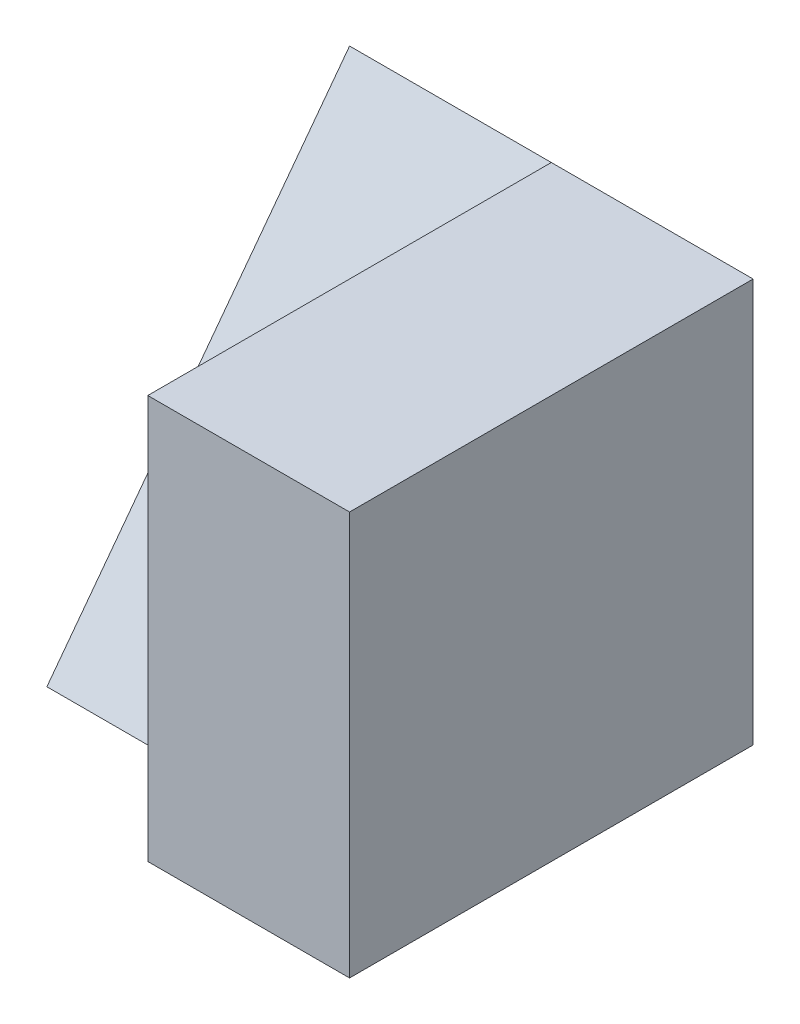
ISO-10303-21;
HEADER;
FILE_DESCRIPTION(('STEP AP214'),'2;1');
FILE_NAME('part.step','',(''),(''),'','','');
FILE_SCHEMA(('AUTOMOTIVE_DESIGN { 1 0 10303 214 1 1 1 1 }'));
ENDSEC;
DATA;
#1=APPLICATION_CONTEXT('core data for automotive mechanical design processes');
#2=APPLICATION_PROTOCOL_DEFINITION('international standard','automotive_design',2000,#1);
#3=PRODUCT_CONTEXT('',#1,'mechanical');
#4=PRODUCT('Part','Part','',(#3));
#5=PRODUCT_RELATED_PRODUCT_CATEGORY('part','',(#4));
#6=PRODUCT_DEFINITION_FORMATION('','',#4);
#7=PRODUCT_DEFINITION_CONTEXT('part definition',#1,'design');
#8=PRODUCT_DEFINITION('design','',#6,#7);
#9=PRODUCT_DEFINITION_SHAPE('','',#8);
#10=(LENGTH_UNIT() NAMED_UNIT(*) SI_UNIT(.MILLI.,.METRE.));
#11=(NAMED_UNIT(*) PLANE_ANGLE_UNIT() SI_UNIT($,.RADIAN.));
#12=(NAMED_UNIT(*) SI_UNIT($,.STERADIAN.) SOLID_ANGLE_UNIT());
#13=UNCERTAINTY_MEASURE_WITH_UNIT(LENGTH_MEASURE(1.E-05),#10,'distance_accuracy_value','');
#14=(GEOMETRIC_REPRESENTATION_CONTEXT(3) GLOBAL_UNCERTAINTY_ASSIGNED_CONTEXT((#13)) GLOBAL_UNIT_ASSIGNED_CONTEXT((#10,
#11,#12)) REPRESENTATION_CONTEXT('',''));
#15=CARTESIAN_POINT('',(0.,0.,0.));
#16=DIRECTION('',(0.,0.,1.));
#17=DIRECTION('',(1.,0.,0.));
#18=AXIS2_PLACEMENT_3D('',#15,#16,#17);
#19=CARTESIAN_POINT('',(0.,0.,4.));
#20=DIRECTION('',(1.,0.,0.));
#21=DIRECTION('',(0.,0.,-1.));
#22=AXIS2_PLACEMENT_3D('',#19,#20,#21);
#23=PLANE('',#22);
#24=DIRECTION('',(0.,0.,-1.));
#25=VECTOR('',#24,1.);
#26=CARTESIAN_POINT('',(0.,0.,4.));
#27=LINE('',#26,#25);
#28=CARTESIAN_POINT('',(0.,0.,3.));
#29=VERTEX_POINT('',#28);
#30=CARTESIAN_POINT('',(0.,0.,0.));
#31=VERTEX_POINT('',#30);
#32=EDGE_CURVE('E11',#29,#31,#27,.T.);
#33=ORIENTED_EDGE('',*,*,#32,.F.);
#34=DIRECTION('',(0.,-0.8,0.6));
#35=VECTOR('',#34,1.);
#36=CARTESIAN_POINT('',(0.,4.,0.));
#37=LINE('',#36,#35);
#38=CARTESIAN_POINT('',(0.,4.,0.));
#39=VERTEX_POINT('',#38);
#40=EDGE_CURVE('E108',#39,#29,#37,.T.);
#41=ORIENTED_EDGE('',*,*,#40,.F.);
#42=DIRECTION('',(0.,-1.,0.));
#43=VECTOR('',#42,1.);
#44=CARTESIAN_POINT('',(0.,0.,0.));
#45=LINE('',#44,#43);
#46=EDGE_CURVE('E98',#39,#31,#45,.T.);
#47=ORIENTED_EDGE('',*,*,#46,.T.);
#48=EDGE_LOOP('',(#33,#41,#47));
#49=FACE_BOUND('',#48,.T.);
#50=ADVANCED_FACE('F33',(#49),#23,.F.);
#51=CARTESIAN_POINT('',(0.,0.,4.));
#52=DIRECTION('',(0.,1.,0.));
#53=DIRECTION('',(0.,0.,1.));
#54=AXIS2_PLACEMENT_3D('',#51,#52,#53);
#55=PLANE('',#54);
#56=DIRECTION('',(0.,0.,1.));
#57=VECTOR('',#56,1.);
#58=CARTESIAN_POINT('',(2.,0.,3.));
#59=LINE('',#58,#57);
#60=CARTESIAN_POINT('',(2.,0.,3.));
#61=VERTEX_POINT('',#60);
#62=CARTESIAN_POINT('',(2.,0.,4.));
#63=VERTEX_POINT('',#62);
#64=EDGE_CURVE('E112',#61,#63,#59,.T.);
#65=ORIENTED_EDGE('',*,*,#64,.F.);
#66=DIRECTION('',(-1.,0.,0.));
#67=VECTOR('',#66,1.);
#68=CARTESIAN_POINT('',(2.,0.,3.));
#69=LINE('',#68,#67);
#70=EDGE_CURVE('E101',#61,#29,#69,.T.);
#71=ORIENTED_EDGE('',*,*,#70,.T.);
#72=ORIENTED_EDGE('',*,*,#32,.T.);
#73=DIRECTION('',(1.,0.,0.));
#74=VECTOR('',#73,1.);
#75=CARTESIAN_POINT('',(0.,0.,0.));
#76=LINE('',#75,#74);
#77=CARTESIAN_POINT('',(4.,0.,0.));
#78=VERTEX_POINT('',#77);
#79=EDGE_CURVE('E81',#31,#78,#76,.T.);
#80=ORIENTED_EDGE('',*,*,#79,.T.);
#81=DIRECTION('',(0.,0.,-1.));
#82=VECTOR('',#81,1.);
#83=CARTESIAN_POINT('',(4.,0.,4.));
#84=LINE('',#83,#82);
#85=CARTESIAN_POINT('',(4.,0.,4.));
#86=VERTEX_POINT('',#85);
#87=EDGE_CURVE('E40',#86,#78,#84,.T.);
#88=ORIENTED_EDGE('',*,*,#87,.F.);
#89=DIRECTION('',(1.,0.,0.));
#90=VECTOR('',#89,1.);
#91=CARTESIAN_POINT('',(0.,0.,4.));
#92=LINE('',#91,#90);
#93=EDGE_CURVE('E93',#63,#86,#92,.T.);
#94=ORIENTED_EDGE('',*,*,#93,.F.);
#95=EDGE_LOOP('',(#65,#71,#72,#80,#88,#94));
#96=FACE_BOUND('',#95,.T.);
#97=ADVANCED_FACE('F128',(#96),#55,.F.);
#98=CARTESIAN_POINT('',(4.,0.,4.));
#99=DIRECTION('',(-1.,0.,0.));
#100=DIRECTION('',(0.,0.,1.));
#101=AXIS2_PLACEMENT_3D('',#98,#99,#100);
#102=PLANE('',#101);
#103=DIRECTION('',(0.,1.,0.));
#104=VECTOR('',#103,1.);
#105=CARTESIAN_POINT('',(4.,0.,0.));
#106=LINE('',#105,#104);
#107=CARTESIAN_POINT('',(4.,4.,0.));
#108=VERTEX_POINT('',#107);
#109=EDGE_CURVE('E71',#78,#108,#106,.T.);
#110=ORIENTED_EDGE('',*,*,#109,.T.);
#111=DIRECTION('',(0.,0.,-1.));
#112=VECTOR('',#111,1.);
#113=CARTESIAN_POINT('',(4.,4.,4.));
#114=LINE('',#113,#112);
#115=CARTESIAN_POINT('',(4.,4.,4.));
#116=VERTEX_POINT('',#115);
#117=EDGE_CURVE('E74',#116,#108,#114,.T.);
#118=ORIENTED_EDGE('',*,*,#117,.F.);
#119=DIRECTION('',(0.,1.,0.));
#120=VECTOR('',#119,1.);
#121=CARTESIAN_POINT('',(4.,0.,4.));
#122=LINE('',#121,#120);
#123=EDGE_CURVE('E56',#86,#116,#122,.T.);
#124=ORIENTED_EDGE('',*,*,#123,.F.);
#125=ORIENTED_EDGE('',*,*,#87,.T.);
#126=EDGE_LOOP('',(#110,#118,#124,#125));
#127=FACE_BOUND('',#126,.T.);
#128=ADVANCED_FACE('F73',(#127),#102,.F.);
#129=CARTESIAN_POINT('',(0.,4.,4.));
#130=DIRECTION('',(0.,-1.,0.));
#131=DIRECTION('',(0.,0.,-1.));
#132=AXIS2_PLACEMENT_3D('',#129,#130,#131);
#133=PLANE('',#132);
#134=DIRECTION('',(-1.,0.,0.));
#135=VECTOR('',#134,1.);
#136=CARTESIAN_POINT('',(0.,4.,0.));
#137=LINE('',#136,#135);
#138=CARTESIAN_POINT('',(2.,4.,0.));
#139=VERTEX_POINT('',#138);
#140=EDGE_CURVE('E80',#108,#139,#137,.T.);
#141=ORIENTED_EDGE('',*,*,#140,.T.);
#142=DIRECTION('',(0.,0.,-1.));
#143=VECTOR('',#142,1.);
#144=CARTESIAN_POINT('',(2.,4.,4.));
#145=LINE('',#144,#143);
#146=CARTESIAN_POINT('',(2.,4.,4.));
#147=VERTEX_POINT('',#146);
#148=EDGE_CURVE('E47',#147,#139,#145,.T.);
#149=ORIENTED_EDGE('',*,*,#148,.F.);
#150=DIRECTION('',(-1.,0.,0.));
#151=VECTOR('',#150,1.);
#152=CARTESIAN_POINT('',(0.,4.,4.));
#153=LINE('',#152,#151);
#154=EDGE_CURVE('E86',#116,#147,#153,.T.);
#155=ORIENTED_EDGE('',*,*,#154,.F.);
#156=ORIENTED_EDGE('',*,*,#117,.T.);
#157=EDGE_LOOP('',(#141,#149,#155,#156));
#158=FACE_BOUND('',#157,.T.);
#159=ADVANCED_FACE('F85',(#158),#133,.F.);
#160=CARTESIAN_POINT('',(0.,0.,4.));
#161=DIRECTION('',(0.,0.,-1.));
#162=DIRECTION('',(-1.,0.,0.));
#163=AXIS2_PLACEMENT_3D('',#160,#161,#162);
#164=PLANE('',#163);
#165=ORIENTED_EDGE('',*,*,#154,.T.);
#166=DIRECTION('',(0.,1.,0.));
#167=VECTOR('',#166,1.);
#168=CARTESIAN_POINT('',(2.,0.,4.));
#169=LINE('',#168,#167);
#170=EDGE_CURVE('E105',#63,#147,#169,.T.);
#171=ORIENTED_EDGE('',*,*,#170,.F.);
#172=ORIENTED_EDGE('',*,*,#93,.T.);
#173=ORIENTED_EDGE('',*,*,#123,.T.);
#174=EDGE_LOOP('',(#165,#171,#172,#173));
#175=FACE_BOUND('',#174,.T.);
#176=ADVANCED_FACE('F131',(#175),#164,.F.);
#177=CARTESIAN_POINT('',(0.,0.,0.));
#178=DIRECTION('',(0.,0.,-1.));
#179=DIRECTION('',(-1.,0.,0.));
#180=AXIS2_PLACEMENT_3D('',#177,#178,#179);
#181=PLANE('',#180);
#182=ORIENTED_EDGE('',*,*,#46,.F.);
#183=DIRECTION('',(-1.,0.,0.));
#184=VECTOR('',#183,1.);
#185=CARTESIAN_POINT('',(2.,4.,0.));
#186=LINE('',#185,#184);
#187=EDGE_CURVE('E92',#139,#39,#186,.T.);
#188=ORIENTED_EDGE('',*,*,#187,.F.);
#189=ORIENTED_EDGE('',*,*,#140,.F.);
#190=ORIENTED_EDGE('',*,*,#109,.F.);
#191=ORIENTED_EDGE('',*,*,#79,.F.);
#192=EDGE_LOOP('',(#182,#188,#189,#190,#191));
#193=FACE_BOUND('',#192,.T.);
#194=ADVANCED_FACE('F90',(#193),#181,.T.);
#195=CARTESIAN_POINT('',(2.,4.,0.));
#196=DIRECTION('',(0.,-0.6,-0.8));
#197=DIRECTION('',(0.,0.8,-0.6));
#198=AXIS2_PLACEMENT_3D('',#195,#196,#197);
#199=PLANE('',#198);
#200=ORIENTED_EDGE('',*,*,#40,.T.);
#201=ORIENTED_EDGE('',*,*,#70,.F.);
#202=DIRECTION('',(0.,-0.8,0.6));
#203=VECTOR('',#202,1.);
#204=CARTESIAN_POINT('',(2.,4.,0.));
#205=LINE('',#204,#203);
#206=EDGE_CURVE('E115',#139,#61,#205,.T.);
#207=ORIENTED_EDGE('',*,*,#206,.F.);
#208=ORIENTED_EDGE('',*,*,#187,.T.);
#209=EDGE_LOOP('',(#200,#201,#207,#208));
#210=FACE_BOUND('',#209,.T.);
#211=ADVANCED_FACE('F136',(#210),#199,.F.);
#212=CARTESIAN_POINT('',(2.,0.,0.));
#213=DIRECTION('',(1.,0.,0.));
#214=DIRECTION('',(0.,0.,-1.));
#215=AXIS2_PLACEMENT_3D('',#212,#213,#214);
#216=PLANE('',#215);
#217=ORIENTED_EDGE('',*,*,#148,.T.);
#218=ORIENTED_EDGE('',*,*,#206,.T.);
#219=ORIENTED_EDGE('',*,*,#64,.T.);
#220=ORIENTED_EDGE('',*,*,#170,.T.);
#221=EDGE_LOOP('',(#217,#218,#219,#220));
#222=FACE_BOUND('',#221,.T.);
#223=ADVANCED_FACE('F119',(#222),#216,.F.);
#224=CLOSED_SHELL('',(#50,#97,#128,#159,#176,#194,#211,#223));
#225=MANIFOLD_SOLID_BREP('B2',#224);
#226=ADVANCED_BREP_SHAPE_REPRESENTATION('',(#18,#225),#14);
#227=SHAPE_DEFINITION_REPRESENTATION(#9,#226);
ENDSEC;
END-ISO-10303-21;
